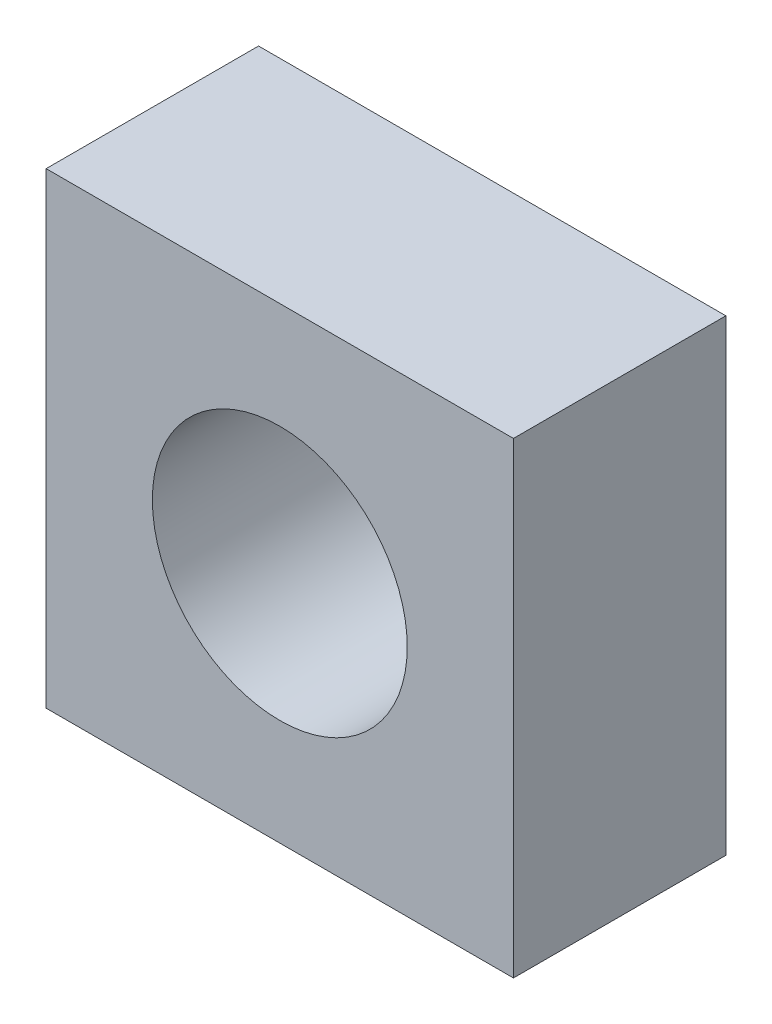
ISO-10303-21;
HEADER;
FILE_DESCRIPTION(('STEP AP214'),'2;1');
FILE_NAME('part.step','',(''),(''),'','','');
FILE_SCHEMA(('AUTOMOTIVE_DESIGN { 1 0 10303 214 1 1 1 1 }'));
ENDSEC;
DATA;
#1=APPLICATION_CONTEXT('core data for automotive mechanical design processes');
#2=APPLICATION_PROTOCOL_DEFINITION('international standard','automotive_design',2000,#1);
#3=PRODUCT_CONTEXT('',#1,'mechanical');
#4=PRODUCT('Part','Part','',(#3));
#5=PRODUCT_RELATED_PRODUCT_CATEGORY('part','',(#4));
#6=PRODUCT_DEFINITION_FORMATION('','',#4);
#7=PRODUCT_DEFINITION_CONTEXT('part definition',#1,'design');
#8=PRODUCT_DEFINITION('design','',#6,#7);
#9=PRODUCT_DEFINITION_SHAPE('','',#8);
#10=(LENGTH_UNIT() NAMED_UNIT(*) SI_UNIT(.MILLI.,.METRE.));
#11=(NAMED_UNIT(*) PLANE_ANGLE_UNIT() SI_UNIT($,.RADIAN.));
#12=(NAMED_UNIT(*) SI_UNIT($,.STERADIAN.) SOLID_ANGLE_UNIT());
#13=UNCERTAINTY_MEASURE_WITH_UNIT(LENGTH_MEASURE(1.E-05),#10,'distance_accuracy_value','');
#14=(GEOMETRIC_REPRESENTATION_CONTEXT(3) GLOBAL_UNCERTAINTY_ASSIGNED_CONTEXT((#13)) GLOBAL_UNIT_ASSIGNED_CONTEXT((#10,
#11,#12)) REPRESENTATION_CONTEXT('',''));
#15=CARTESIAN_POINT('',(0.,0.,0.));
#16=DIRECTION('',(0.,0.,1.));
#17=DIRECTION('',(1.,0.,0.));
#18=AXIS2_PLACEMENT_3D('',#15,#16,#17);
#19=CARTESIAN_POINT('',(0.,0.,2.5));
#20=DIRECTION('',(0.,0.,-1.));
#21=DIRECTION('',(-1.,0.,0.));
#22=AXIS2_PLACEMENT_3D('',#19,#20,#21);
#23=PLANE('',#22);
#24=DIRECTION('',(0.,1.,0.));
#25=VECTOR('',#24,1.);
#26=CARTESIAN_POINT('',(2.75,-2.75,2.5));
#27=LINE('',#26,#25);
#28=CARTESIAN_POINT('',(2.75,-2.75,2.5));
#29=VERTEX_POINT('',#28);
#30=CARTESIAN_POINT('',(2.75,2.75,2.5));
#31=VERTEX_POINT('',#30);
#32=EDGE_CURVE('E100',#29,#31,#27,.T.);
#33=ORIENTED_EDGE('',*,*,#32,.T.);
#34=DIRECTION('',(-1.,0.,0.));
#35=VECTOR('',#34,1.);
#36=CARTESIAN_POINT('',(-2.75,2.75,2.5));
#37=LINE('',#36,#35);
#38=CARTESIAN_POINT('',(-2.75,2.75,2.5));
#39=VERTEX_POINT('',#38);
#40=EDGE_CURVE('E95',#31,#39,#37,.T.);
#41=ORIENTED_EDGE('',*,*,#40,.T.);
#42=DIRECTION('',(0.,-1.,0.));
#43=VECTOR('',#42,1.);
#44=CARTESIAN_POINT('',(-2.75,-2.75,2.5));
#45=LINE('',#44,#43);
#46=CARTESIAN_POINT('',(-2.75,-2.75,2.5));
#47=VERTEX_POINT('',#46);
#48=EDGE_CURVE('E98',#39,#47,#45,.T.);
#49=ORIENTED_EDGE('',*,*,#48,.T.);
#50=DIRECTION('',(1.,0.,0.));
#51=VECTOR('',#50,1.);
#52=CARTESIAN_POINT('',(-2.75,-2.75,2.5));
#53=LINE('',#52,#51);
#54=EDGE_CURVE('E65',#47,#29,#53,.T.);
#55=ORIENTED_EDGE('',*,*,#54,.T.);
#56=EDGE_LOOP('',(#33,#41,#49,#55));
#57=FACE_BOUND('',#56,.T.);
#58=CARTESIAN_POINT('',(0.,0.,2.5));
#59=DIRECTION('',(0.,0.,1.));
#60=DIRECTION('',(1.,0.,0.));
#61=AXIS2_PLACEMENT_3D('',#58,#59,#60);
#62=CIRCLE('',#61,1.5);
#63=CARTESIAN_POINT('',(1.5,0.,2.5));
#64=VERTEX_POINT('',#63);
#65=EDGE_CURVE('E120',#64,#64,#62,.T.);
#66=ORIENTED_EDGE('',*,*,#65,.F.);
#67=EDGE_LOOP('',(#66));
#68=FACE_BOUND('',#67,.T.);
#69=ADVANCED_FACE('F47',(#57,#68),#23,.F.);
#70=CARTESIAN_POINT('',(0.,0.,0.));
#71=DIRECTION('',(0.,0.,-1.));
#72=DIRECTION('',(-1.,0.,0.));
#73=AXIS2_PLACEMENT_3D('',#70,#71,#72);
#74=PLANE('',#73);
#75=DIRECTION('',(0.,1.,0.));
#76=VECTOR('',#75,1.);
#77=CARTESIAN_POINT('',(2.75,-2.75,0.));
#78=LINE('',#77,#76);
#79=CARTESIAN_POINT('',(2.75,-2.75,0.));
#80=VERTEX_POINT('',#79);
#81=CARTESIAN_POINT('',(2.75,2.75,0.));
#82=VERTEX_POINT('',#81);
#83=EDGE_CURVE('E116',#80,#82,#78,.T.);
#84=ORIENTED_EDGE('',*,*,#83,.F.);
#85=DIRECTION('',(1.,0.,0.));
#86=VECTOR('',#85,1.);
#87=CARTESIAN_POINT('',(-2.75,-2.75,0.));
#88=LINE('',#87,#86);
#89=CARTESIAN_POINT('',(-2.75,-2.75,0.));
#90=VERTEX_POINT('',#89);
#91=EDGE_CURVE('E88',#90,#80,#88,.T.);
#92=ORIENTED_EDGE('',*,*,#91,.F.);
#93=DIRECTION('',(0.,-1.,0.));
#94=VECTOR('',#93,1.);
#95=CARTESIAN_POINT('',(-2.75,-2.75,0.));
#96=LINE('',#95,#94);
#97=CARTESIAN_POINT('',(-2.75,2.75,0.));
#98=VERTEX_POINT('',#97);
#99=EDGE_CURVE('E82',#98,#90,#96,.T.);
#100=ORIENTED_EDGE('',*,*,#99,.F.);
#101=DIRECTION('',(-1.,0.,0.));
#102=VECTOR('',#101,1.);
#103=CARTESIAN_POINT('',(-2.75,2.75,0.));
#104=LINE('',#103,#102);
#105=EDGE_CURVE('E105',#82,#98,#104,.T.);
#106=ORIENTED_EDGE('',*,*,#105,.F.);
#107=EDGE_LOOP('',(#84,#92,#100,#106));
#108=FACE_BOUND('',#107,.T.);
#109=CARTESIAN_POINT('',(0.,0.,0.));
#110=DIRECTION('',(0.,0.,1.));
#111=DIRECTION('',(1.,0.,0.));
#112=AXIS2_PLACEMENT_3D('',#109,#110,#111);
#113=CIRCLE('',#112,1.5);
#114=CARTESIAN_POINT('',(1.5,0.,0.));
#115=VERTEX_POINT('',#114);
#116=EDGE_CURVE('E138',#115,#115,#113,.T.);
#117=ORIENTED_EDGE('',*,*,#116,.T.);
#118=EDGE_LOOP('',(#117));
#119=FACE_BOUND('',#118,.T.);
#120=ADVANCED_FACE('F133',(#108,#119),#74,.T.);
#121=CARTESIAN_POINT('',(2.75,-2.75,2.5));
#122=DIRECTION('',(-1.,0.,0.));
#123=DIRECTION('',(0.,0.,1.));
#124=AXIS2_PLACEMENT_3D('',#121,#122,#123);
#125=PLANE('',#124);
#126=ORIENTED_EDGE('',*,*,#83,.T.);
#127=DIRECTION('',(0.,0.,-1.));
#128=VECTOR('',#127,1.);
#129=CARTESIAN_POINT('',(2.75,2.75,2.5));
#130=LINE('',#129,#128);
#131=EDGE_CURVE('E11',#31,#82,#130,.T.);
#132=ORIENTED_EDGE('',*,*,#131,.F.);
#133=ORIENTED_EDGE('',*,*,#32,.F.);
#134=DIRECTION('',(0.,0.,-1.));
#135=VECTOR('',#134,1.);
#136=CARTESIAN_POINT('',(2.75,-2.75,2.5));
#137=LINE('',#136,#135);
#138=EDGE_CURVE('E112',#29,#80,#137,.T.);
#139=ORIENTED_EDGE('',*,*,#138,.T.);
#140=EDGE_LOOP('',(#126,#132,#133,#139));
#141=FACE_BOUND('',#140,.T.);
#142=ADVANCED_FACE('F49',(#141),#125,.F.);
#143=CARTESIAN_POINT('',(-2.75,2.75,2.5));
#144=DIRECTION('',(0.,-1.,0.));
#145=DIRECTION('',(0.,0.,-1.));
#146=AXIS2_PLACEMENT_3D('',#143,#144,#145);
#147=PLANE('',#146);
#148=ORIENTED_EDGE('',*,*,#105,.T.);
#149=DIRECTION('',(0.,0.,-1.));
#150=VECTOR('',#149,1.);
#151=CARTESIAN_POINT('',(-2.75,2.75,2.5));
#152=LINE('',#151,#150);
#153=EDGE_CURVE('E57',#39,#98,#152,.T.);
#154=ORIENTED_EDGE('',*,*,#153,.F.);
#155=ORIENTED_EDGE('',*,*,#40,.F.);
#156=ORIENTED_EDGE('',*,*,#131,.T.);
#157=EDGE_LOOP('',(#148,#154,#155,#156));
#158=FACE_BOUND('',#157,.T.);
#159=ADVANCED_FACE('F104',(#158),#147,.F.);
#160=CARTESIAN_POINT('',(-2.75,-2.75,2.5));
#161=DIRECTION('',(1.,0.,0.));
#162=DIRECTION('',(0.,0.,-1.));
#163=AXIS2_PLACEMENT_3D('',#160,#161,#162);
#164=PLANE('',#163);
#165=ORIENTED_EDGE('',*,*,#99,.T.);
#166=DIRECTION('',(0.,0.,-1.));
#167=VECTOR('',#166,1.);
#168=CARTESIAN_POINT('',(-2.75,-2.75,2.5));
#169=LINE('',#168,#167);
#170=EDGE_CURVE('E107',#47,#90,#169,.T.);
#171=ORIENTED_EDGE('',*,*,#170,.F.);
#172=ORIENTED_EDGE('',*,*,#48,.F.);
#173=ORIENTED_EDGE('',*,*,#153,.T.);
#174=EDGE_LOOP('',(#165,#171,#172,#173));
#175=FACE_BOUND('',#174,.T.);
#176=ADVANCED_FACE('F108',(#175),#164,.F.);
#177=CARTESIAN_POINT('',(-2.75,-2.75,2.5));
#178=DIRECTION('',(0.,1.,0.));
#179=DIRECTION('',(0.,0.,1.));
#180=AXIS2_PLACEMENT_3D('',#177,#178,#179);
#181=PLANE('',#180);
#182=ORIENTED_EDGE('',*,*,#91,.T.);
#183=ORIENTED_EDGE('',*,*,#138,.F.);
#184=ORIENTED_EDGE('',*,*,#54,.F.);
#185=ORIENTED_EDGE('',*,*,#170,.T.);
#186=EDGE_LOOP('',(#182,#183,#184,#185));
#187=FACE_BOUND('',#186,.T.);
#188=ADVANCED_FACE('F130',(#187),#181,.F.);
#189=CARTESIAN_POINT('',(0.,0.,2.5));
#190=DIRECTION('',(0.,0.,-1.));
#191=DIRECTION('',(-1.,0.,0.));
#192=AXIS2_PLACEMENT_3D('',#189,#190,#191);
#193=CYLINDRICAL_SURFACE('',#192,1.5);
#194=ORIENTED_EDGE('',*,*,#65,.T.);
#195=EDGE_LOOP('',(#194));
#196=FACE_BOUND('',#195,.T.);
#197=ORIENTED_EDGE('',*,*,#116,.F.);
#198=EDGE_LOOP('',(#197));
#199=FACE_BOUND('',#198,.T.);
#200=ADVANCED_FACE('F146',(#196,#199),#193,.F.);
#201=CLOSED_SHELL('',(#69,#120,#142,#159,#176,#188,#200));
#202=MANIFOLD_SOLID_BREP('B2',#201);
#203=ADVANCED_BREP_SHAPE_REPRESENTATION('',(#18,#202),#14);
#204=SHAPE_DEFINITION_REPRESENTATION(#9,#203);
ENDSEC;
END-ISO-10303-21;
